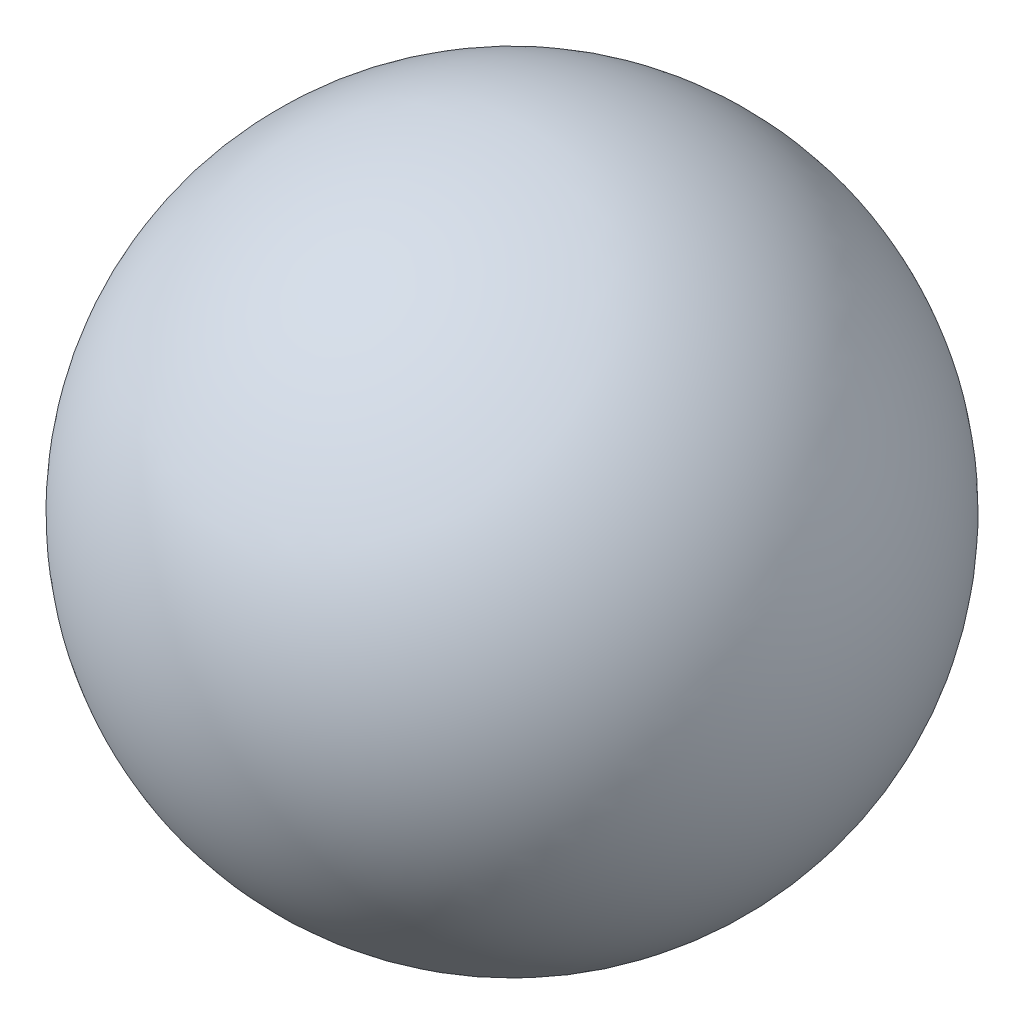
ISO-10303-21;
HEADER;
FILE_DESCRIPTION(('STEP AP214'),'2;1');
FILE_NAME('part.step','',(''),(''),'','','');
FILE_SCHEMA(('AUTOMOTIVE_DESIGN { 1 0 10303 214 1 1 1 1 }'));
ENDSEC;
DATA;
#1=APPLICATION_CONTEXT('core data for automotive mechanical design processes');
#2=APPLICATION_PROTOCOL_DEFINITION('international standard','automotive_design',2000,#1);
#3=PRODUCT_CONTEXT('',#1,'mechanical');
#4=PRODUCT('Part','Part','',(#3));
#5=PRODUCT_RELATED_PRODUCT_CATEGORY('part','',(#4));
#6=PRODUCT_DEFINITION_FORMATION('','',#4);
#7=PRODUCT_DEFINITION_CONTEXT('part definition',#1,'design');
#8=PRODUCT_DEFINITION('design','',#6,#7);
#9=PRODUCT_DEFINITION_SHAPE('','',#8);
#10=(LENGTH_UNIT() NAMED_UNIT(*) SI_UNIT(.MILLI.,.METRE.));
#11=(NAMED_UNIT(*) PLANE_ANGLE_UNIT() SI_UNIT($,.RADIAN.));
#12=(NAMED_UNIT(*) SI_UNIT($,.STERADIAN.) SOLID_ANGLE_UNIT());
#13=UNCERTAINTY_MEASURE_WITH_UNIT(LENGTH_MEASURE(1.E-05),#10,'distance_accuracy_value','');
#14=(GEOMETRIC_REPRESENTATION_CONTEXT(3) GLOBAL_UNCERTAINTY_ASSIGNED_CONTEXT((#13)) GLOBAL_UNIT_ASSIGNED_CONTEXT((#10,
#11,#12)) REPRESENTATION_CONTEXT('',''));
#15=CARTESIAN_POINT('',(0.,0.,0.));
#16=DIRECTION('',(0.,0.,1.));
#17=DIRECTION('',(1.,0.,0.));
#18=AXIS2_PLACEMENT_3D('',#15,#16,#17);
#19=CARTESIAN_POINT('',(-11.7366912354003,-2.,0.559087510928976));
#20=DIRECTION('',(0.,0.,1.));
#21=DIRECTION('',(1.,0.,0.));
#22=AXIS2_PLACEMENT_3D('',#19,#20,#21);
#23=SPHERICAL_SURFACE('',#22,1.05);
#24=CARTESIAN_POINT('',(-11.7366912354003,-2.,1.60908751092898));
#25=VERTEX_POINT('',#24);
#26=VERTEX_LOOP('',#25);
#27=FACE_BOUND('',#26,.T.);
#28=ADVANCED_FACE('F13',(#27),#23,.T.);
#29=CLOSED_SHELL('',(#28));
#30=MANIFOLD_SOLID_BREP('B1',#29);
#31=ADVANCED_BREP_SHAPE_REPRESENTATION('',(#18,#30),#14);
#32=SHAPE_DEFINITION_REPRESENTATION(#9,#31);
ENDSEC;
END-ISO-10303-21;
